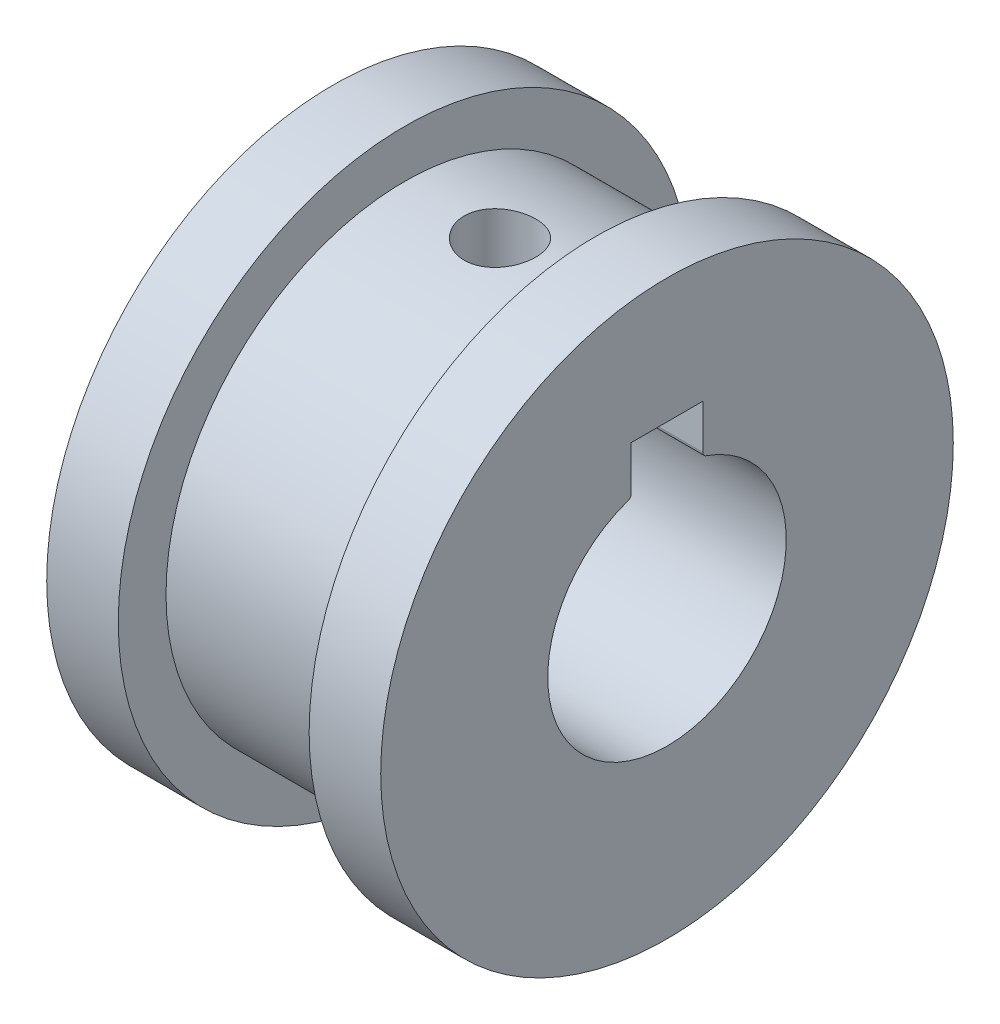
ISO-10303-21;
HEADER;
FILE_DESCRIPTION(('STEP AP214'),'2;1');
FILE_NAME('part.step','',(''),(''),'','','');
FILE_SCHEMA(('AUTOMOTIVE_DESIGN { 1 0 10303 214 1 1 1 1 }'));
ENDSEC;
DATA;
#1=APPLICATION_CONTEXT('core data for automotive mechanical design processes');
#2=APPLICATION_PROTOCOL_DEFINITION('international standard','automotive_design',2000,#1);
#3=PRODUCT_CONTEXT('',#1,'mechanical');
#4=PRODUCT('Part','Part','',(#3));
#5=PRODUCT_RELATED_PRODUCT_CATEGORY('part','',(#4));
#6=PRODUCT_DEFINITION_FORMATION('','',#4);
#7=PRODUCT_DEFINITION_CONTEXT('part definition',#1,'design');
#8=PRODUCT_DEFINITION('design','',#6,#7);
#9=PRODUCT_DEFINITION_SHAPE('','',#8);
#10=(LENGTH_UNIT() NAMED_UNIT(*) SI_UNIT(.MILLI.,.METRE.));
#11=(NAMED_UNIT(*) PLANE_ANGLE_UNIT() SI_UNIT($,.RADIAN.));
#12=(NAMED_UNIT(*) SI_UNIT($,.STERADIAN.) SOLID_ANGLE_UNIT());
#13=UNCERTAINTY_MEASURE_WITH_UNIT(LENGTH_MEASURE(1.E-05),#10,'distance_accuracy_value','');
#14=(GEOMETRIC_REPRESENTATION_CONTEXT(3) GLOBAL_UNCERTAINTY_ASSIGNED_CONTEXT((#13)) GLOBAL_UNIT_ASSIGNED_CONTEXT((#10,
#11,#12)) REPRESENTATION_CONTEXT('',''));
#15=CARTESIAN_POINT('',(0.,0.,0.));
#16=DIRECTION('',(0.,0.,1.));
#17=DIRECTION('',(1.,0.,0.));
#18=AXIS2_PLACEMENT_3D('',#15,#16,#17);
#19=CARTESIAN_POINT('',(11.,6.76969600708473,1.5));
#20=DIRECTION('',(0.,-1.,0.));
#21=DIRECTION('',(0.,0.,-1.));
#22=AXIS2_PLACEMENT_3D('',#19,#20,#21);
#23=PLANE('',#22);
#24=CARTESIAN_POINT('',(4.,6.76969600708473,0.));
#25=DIRECTION('',(0.,-1.,0.));
#26=DIRECTION('',(0.,0.,-1.));
#27=AXIS2_PLACEMENT_3D('',#24,#25,#26);
#28=CIRCLE('',#27,1.5);
#29=CARTESIAN_POINT('',(4.,6.76969600708473,-1.5));
#30=VERTEX_POINT('',#29);
#31=CARTESIAN_POINT('',(4.,6.76969600708473,1.5));
#32=VERTEX_POINT('',#31);
#33=EDGE_CURVE('E48',#30,#32,#28,.T.);
#34=ORIENTED_EDGE('',*,*,#33,.F.);
#35=DIRECTION('',(-1.,0.,0.));
#36=VECTOR('',#35,1.);
#37=CARTESIAN_POINT('',(11.,6.76969600708473,-1.5));
#38=LINE('',#37,#36);
#39=CARTESIAN_POINT('',(11.,6.76969600708473,-1.5));
#40=VERTEX_POINT('',#39);
#41=EDGE_CURVE('E100',#40,#30,#38,.T.);
#42=ORIENTED_EDGE('',*,*,#41,.F.);
#43=DIRECTION('',(0.,0.,1.));
#44=VECTOR('',#43,1.);
#45=CARTESIAN_POINT('',(11.,6.76969600708473,1.5));
#46=LINE('',#45,#44);
#47=CARTESIAN_POINT('',(11.,6.76969600708473,1.5));
#48=VERTEX_POINT('',#47);
#49=EDGE_CURVE('E217',#40,#48,#46,.T.);
#50=ORIENTED_EDGE('',*,*,#49,.T.);
#51=DIRECTION('',(-1.,0.,0.));
#52=VECTOR('',#51,1.);
#53=CARTESIAN_POINT('',(11.,6.76969600708473,1.5));
#54=LINE('',#53,#52);
#55=EDGE_CURVE('E56',#48,#32,#54,.T.);
#56=ORIENTED_EDGE('',*,*,#55,.T.);
#57=EDGE_LOOP('',(#34,#42,#50,#56));
#58=FACE_BOUND('',#57,.T.);
#59=ADVANCED_FACE('F32',(#58),#23,.T.);
#60=CARTESIAN_POINT('',(11.,0.,0.));
#61=DIRECTION('',(1.,0.,0.));
#62=DIRECTION('',(0.,0.,-1.));
#63=AXIS2_PLACEMENT_3D('',#60,#61,#62);
#64=PLANE('',#63);
#65=CARTESIAN_POINT('',(11.,0.,0.));
#66=DIRECTION('',(1.,0.,0.));
#67=DIRECTION('',(0.,0.,-1.));
#68=AXIS2_PLACEMENT_3D('',#65,#66,#67);
#69=CIRCLE('',#68,12.);
#70=CARTESIAN_POINT('',(11.,0.,-12.));
#71=VERTEX_POINT('',#70);
#72=EDGE_CURVE('E42',#71,#71,#69,.T.);
#73=ORIENTED_EDGE('',*,*,#72,.T.);
#74=EDGE_LOOP('',(#73));
#75=FACE_BOUND('',#74,.T.);
#76=CARTESIAN_POINT('',(11.,0.,0.));
#77=DIRECTION('',(1.,0.,0.));
#78=DIRECTION('',(0.,0.,-1.));
#79=AXIS2_PLACEMENT_3D('',#76,#77,#78);
#80=CIRCLE('',#79,5.);
#81=CARTESIAN_POINT('',(11.,4.72525475973293,1.63461538461539));
#82=VERTEX_POINT('',#81);
#83=CARTESIAN_POINT('',(11.,4.72525475973293,-1.63461538461538));
#84=VERTEX_POINT('',#83);
#85=EDGE_CURVE('E207',#82,#84,#80,.T.);
#86=ORIENTED_EDGE('',*,*,#85,.F.);
#87=CARTESIAN_POINT('',(11.,4.91426495012224,1.7));
#88=DIRECTION('',(-1.,0.,0.));
#89=DIRECTION('',(0.,0.,-1.));
#90=AXIS2_PLACEMENT_3D('',#87,#88,#89);
#91=CIRCLE('',#90,0.2);
#92=CARTESIAN_POINT('',(11.,4.91426495012224,1.5));
#93=VERTEX_POINT('',#92);
#94=EDGE_CURVE('E205',#93,#82,#91,.T.);
#95=ORIENTED_EDGE('',*,*,#94,.F.);
#96=DIRECTION('',(0.,-1.,0.));
#97=VECTOR('',#96,1.);
#98=CARTESIAN_POINT('',(11.,6.76969600708473,1.5));
#99=LINE('',#98,#97);
#100=EDGE_CURVE('E219',#48,#93,#99,.T.);
#101=ORIENTED_EDGE('',*,*,#100,.F.);
#102=ORIENTED_EDGE('',*,*,#49,.F.);
#103=DIRECTION('',(0.,1.,0.));
#104=VECTOR('',#103,1.);
#105=CARTESIAN_POINT('',(11.,6.76969600708473,-1.5));
#106=LINE('',#105,#104);
#107=CARTESIAN_POINT('',(11.,4.91426495012225,-1.5));
#108=VERTEX_POINT('',#107);
#109=EDGE_CURVE('E115',#108,#40,#106,.T.);
#110=ORIENTED_EDGE('',*,*,#109,.F.);
#111=CARTESIAN_POINT('',(11.,4.91426495012225,-1.7));
#112=DIRECTION('',(-1.,0.,0.));
#113=DIRECTION('',(0.,0.,1.));
#114=AXIS2_PLACEMENT_3D('',#111,#112,#113);
#115=CIRCLE('',#114,0.2);
#116=EDGE_CURVE('E214',#84,#108,#115,.T.);
#117=ORIENTED_EDGE('',*,*,#116,.F.);
#118=EDGE_LOOP('',(#86,#95,#101,#102,#110,#117));
#119=FACE_BOUND('',#118,.T.);
#120=ADVANCED_FACE('F162',(#75,#119),#64,.T.);
#121=CARTESIAN_POINT('',(-3.,0.,0.));
#122=DIRECTION('',(-1.,0.,0.));
#123=DIRECTION('',(0.,0.,1.));
#124=AXIS2_PLACEMENT_3D('',#121,#122,#123);
#125=PLANE('',#124);
#126=CARTESIAN_POINT('',(-3.,0.,0.));
#127=DIRECTION('',(-1.,0.,0.));
#128=DIRECTION('',(0.,0.,1.));
#129=AXIS2_PLACEMENT_3D('',#126,#127,#128);
#130=CIRCLE('',#129,12.);
#131=CARTESIAN_POINT('',(-3.,0.,12.));
#132=VERTEX_POINT('',#131);
#133=EDGE_CURVE('E126',#132,#132,#130,.T.);
#134=ORIENTED_EDGE('',*,*,#133,.T.);
#135=EDGE_LOOP('',(#134));
#136=FACE_BOUND('',#135,.T.);
#137=DIRECTION('',(0.,-1.,0.));
#138=VECTOR('',#137,1.);
#139=CARTESIAN_POINT('',(-3.,6.76969600708473,1.5));
#140=LINE('',#139,#138);
#141=CARTESIAN_POINT('',(-3.,6.76969600708473,1.5));
#142=VERTEX_POINT('',#141);
#143=CARTESIAN_POINT('',(-3.,4.91426495012224,1.5));
#144=VERTEX_POINT('',#143);
#145=EDGE_CURVE('E201',#142,#144,#140,.T.);
#146=ORIENTED_EDGE('',*,*,#145,.T.);
#147=CARTESIAN_POINT('',(-3.,4.91426495012224,1.7));
#148=DIRECTION('',(-1.,0.,0.));
#149=DIRECTION('',(0.,0.,-1.));
#150=AXIS2_PLACEMENT_3D('',#147,#148,#149);
#151=CIRCLE('',#150,0.2);
#152=CARTESIAN_POINT('',(-3.,4.72525475973293,1.63461538461539));
#153=VERTEX_POINT('',#152);
#154=EDGE_CURVE('E203',#144,#153,#151,.T.);
#155=ORIENTED_EDGE('',*,*,#154,.T.);
#156=CARTESIAN_POINT('',(-3.,0.,0.));
#157=DIRECTION('',(1.,0.,0.));
#158=DIRECTION('',(0.,0.,-1.));
#159=AXIS2_PLACEMENT_3D('',#156,#157,#158);
#160=CIRCLE('',#159,5.);
#161=CARTESIAN_POINT('',(-3.,4.72525475973293,-1.63461538461538));
#162=VERTEX_POINT('',#161);
#163=EDGE_CURVE('E234',#153,#162,#160,.T.);
#164=ORIENTED_EDGE('',*,*,#163,.T.);
#165=CARTESIAN_POINT('',(-3.,4.91426495012225,-1.7));
#166=DIRECTION('',(-1.,0.,0.));
#167=DIRECTION('',(0.,0.,1.));
#168=AXIS2_PLACEMENT_3D('',#165,#166,#167);
#169=CIRCLE('',#168,0.2);
#170=CARTESIAN_POINT('',(-3.,4.91426495012225,-1.5));
#171=VERTEX_POINT('',#170);
#172=EDGE_CURVE('E233',#162,#171,#169,.T.);
#173=ORIENTED_EDGE('',*,*,#172,.T.);
#174=DIRECTION('',(0.,1.,0.));
#175=VECTOR('',#174,1.);
#176=CARTESIAN_POINT('',(-3.,6.76969600708473,-1.5));
#177=LINE('',#176,#175);
#178=CARTESIAN_POINT('',(-3.,6.76969600708473,-1.5));
#179=VERTEX_POINT('',#178);
#180=EDGE_CURVE('E209',#171,#179,#177,.T.);
#181=ORIENTED_EDGE('',*,*,#180,.T.);
#182=DIRECTION('',(0.,0.,1.));
#183=VECTOR('',#182,1.);
#184=CARTESIAN_POINT('',(-3.,6.76969600708473,1.5));
#185=LINE('',#184,#183);
#186=EDGE_CURVE('E107',#179,#142,#185,.T.);
#187=ORIENTED_EDGE('',*,*,#186,.T.);
#188=EDGE_LOOP('',(#146,#155,#164,#173,#181,#187));
#189=FACE_BOUND('',#188,.T.);
#190=ADVANCED_FACE('F167',(#136,#189),#125,.T.);
#191=CARTESIAN_POINT('',(8.,0.,0.));
#192=DIRECTION('',(-1.,0.,0.));
#193=DIRECTION('',(0.,0.,1.));
#194=AXIS2_PLACEMENT_3D('',#191,#192,#193);
#195=CYLINDRICAL_SURFACE('',#194,10.);
#196=CARTESIAN_POINT('',(4.,9.88685996664259,-1.5));
#197=CARTESIAN_POINT('',(4.08374556928995,9.88686136668592,-1.49999654107284));
#198=CARTESIAN_POINT('',(4.16753975075071,9.88793551739101,-1.49296296388491));
#199=CARTESIAN_POINT('',(4.33278531488313,9.8921131480324,-1.46502196657001));
#200=CARTESIAN_POINT('',(4.41423433148001,9.8952186073143,-1.44410101402628));
#201=CARTESIAN_POINT('',(4.5723737554469,9.90309938986228,-1.38902526098084));
#202=CARTESIAN_POINT('',(4.64906776254216,9.90787343131536,-1.35488061681397));
#203=CARTESIAN_POINT('',(4.79562703077208,9.91855194113145,-1.27435063087791));
#204=CARTESIAN_POINT('',(4.86549323021429,9.92445625383668,-1.22796697429872));
#205=CARTESIAN_POINT('',(4.99698381675433,9.93678289248039,-1.12387902418558));
#206=CARTESIAN_POINT('',(5.05854561340674,9.94320862458057,-1.0660960558482));
#207=CARTESIAN_POINT('',(5.1711374856555,9.95582368169047,-0.941019605444372));
#208=CARTESIAN_POINT('',(5.22216698216699,9.96201299368614,-0.873725600786528));
#209=CARTESIAN_POINT('',(5.31247663169136,9.97349347428185,-0.731136358052743));
#210=CARTESIAN_POINT('',(5.35169915032246,9.97878018435568,-0.655804227365765));
#211=CARTESIAN_POINT('',(5.41691159880817,9.98782206746404,-0.499528850106973));
#212=CARTESIAN_POINT('',(5.44290222784289,9.99157732141944,-0.418585900270676));
#213=CARTESIAN_POINT('',(5.48072338853084,9.99710914797782,-0.254031123090568));
#214=CARTESIAN_POINT('',(5.49265872638716,9.99890035887344,-0.170443884389865));
#215=CARTESIAN_POINT('',(5.50235593482489,10.0003524476958,-0.00243520401947788));
#216=CARTESIAN_POINT('',(5.50011859331969,10.0000134440494,0.0819861910157475));
#217=CARTESIAN_POINT('',(5.48161666223757,9.99725499660795,0.248551718200521));
#218=CARTESIAN_POINT('',(5.46546482820851,9.99485227652479,0.330708691400009));
#219=CARTESIAN_POINT('',(5.41976939367742,9.98825500227851,0.491132829143139));
#220=CARTESIAN_POINT('',(5.39022544849856,9.98406040199739,0.569399893513483));
#221=CARTESIAN_POINT('',(5.3184690030829,9.97432193873205,0.720163780770318));
#222=CARTESIAN_POINT('',(5.27620903489126,9.96877303515638,0.792637672323598));
#223=CARTESIAN_POINT('',(5.18025480633001,9.95694438245421,0.929507907150179));
#224=CARTESIAN_POINT('',(5.12655979329313,9.95066458523184,0.993903718271737));
#225=CARTESIAN_POINT('',(5.00863155117341,9.93800158192626,1.11345448272265));
#226=CARTESIAN_POINT('',(4.94429987802989,9.93161796623256,1.16851232950947));
#227=CARTESIAN_POINT('',(4.80725892287626,9.91952704453523,1.26706599338813));
#228=CARTESIAN_POINT('',(4.73454958928008,9.91381974269649,1.31056173927999));
#229=CARTESIAN_POINT('',(4.58271603705935,9.90372775286855,1.38476964534605));
#230=CARTESIAN_POINT('',(4.50358686633761,9.89934409845291,1.41547182270082));
#231=CARTESIAN_POINT('',(4.34121474485261,9.89241402899059,1.46312336208879));
#232=CARTESIAN_POINT('',(4.25797208445325,9.88986748446299,1.48007369337326));
#233=CARTESIAN_POINT('',(4.09059991042251,9.88692451395026,1.49960720086656));
#234=CARTESIAN_POINT('',(4.00648681179847,9.88650748802574,1.50232803265052));
#235=CARTESIAN_POINT('',(3.83900580518266,9.88781607937153,1.49369057019819));
#236=CARTESIAN_POINT('',(3.75563787414923,9.88954163015778,1.48233271282302));
#237=CARTESIAN_POINT('',(3.59244018203437,9.89492202461452,1.44597702952766));
#238=CARTESIAN_POINT('',(3.5125947950584,9.89856716482858,1.42104778527821));
#239=CARTESIAN_POINT('',(3.35821590795139,9.90736801825767,1.35832831947087));
#240=CARTESIAN_POINT('',(3.2836826703718,9.91252380607176,1.32053746276389));
#241=CARTESIAN_POINT('',(3.14142673966496,9.92381355687063,1.23283677995324));
#242=CARTESIAN_POINT('',(3.07375955272018,9.92995459279988,1.18283784561766));
#243=CARTESIAN_POINT('',(2.94772714012619,9.94250159433355,1.07226416837202));
#244=CARTESIAN_POINT('',(2.88936244081885,9.94890757490292,1.0116888274468));
#245=CARTESIAN_POINT('',(2.78309739336642,9.96132705217386,0.881075619628185));
#246=CARTESIAN_POINT('',(2.73528827175752,9.96733683460423,0.810963126771959));
#247=CARTESIAN_POINT('',(2.65212709473736,9.97822905032015,0.663622080263683));
#248=CARTESIAN_POINT('',(2.61677469853497,9.98311151444563,0.586393721360441));
#249=CARTESIAN_POINT('',(2.55967625751197,9.99118269660795,0.427297995861149));
#250=CARTESIAN_POINT('',(2.53788033292164,9.99437761717899,0.345448858754304));
#251=CARTESIAN_POINT('',(2.50835212046253,9.99873976656896,0.179200815501195));
#252=CARTESIAN_POINT('',(2.50061890375086,9.99990712930801,0.0948020781305827));
#253=CARTESIAN_POINT('',(2.4994582954506,10.0000812905914,-0.0732645908608166));
#254=CARTESIAN_POINT('',(2.50589131912302,9.99910917023796,-0.15693157021205));
#255=CARTESIAN_POINT('',(2.53258138842076,9.99515610519141,-0.321979795323105));
#256=CARTESIAN_POINT('',(2.55283838980856,9.99217516692666,-0.403361048396511));
#257=CARTESIAN_POINT('',(2.60655187557024,9.98453786742463,-0.561489374379659));
#258=CARTESIAN_POINT('',(2.63999869513893,9.97988273316947,-0.638239793148781));
#259=CARTESIAN_POINT('',(2.71912748798314,9.96940834495499,-0.785061117896601));
#260=CARTESIAN_POINT('',(2.76480985848034,9.96358905320338,-0.855131806920707));
#261=CARTESIAN_POINT('',(2.86761769882917,9.95136510636178,-0.987312585191957));
#262=CARTESIAN_POINT('',(2.92484622581634,9.94495548425941,-1.04934206644638));
#263=CARTESIAN_POINT('',(3.04890507308047,9.93231001689001,-1.16296808390268));
#264=CARTESIAN_POINT('',(3.11573764382434,9.92607421276291,-1.21456216798984));
#265=CARTESIAN_POINT('',(3.25754898323253,9.91444484029116,-1.30611310822974));
#266=CARTESIAN_POINT('',(3.33257141702183,9.90905620156985,-1.34600294291209));
#267=CARTESIAN_POINT('',(3.4882967767633,9.89978909110724,-1.41255613872045));
#268=CARTESIAN_POINT('',(3.56899370785782,9.89590905307931,-1.43923322574897));
#269=CARTESIAN_POINT('',(3.70837743625647,9.89099485524825,-1.47254951890026));
#270=CARTESIAN_POINT('',(3.76620339692427,9.88945249382379,-1.4828276978042));
#271=CARTESIAN_POINT('',(3.88267829173435,9.88738456567011,-1.49655410576574));
#272=CARTESIAN_POINT('',(3.94132721519961,9.88685898576155,-1.50000242335076));
#273=CARTESIAN_POINT('',(4.,9.88685996664259,-1.5));
#274=B_SPLINE_CURVE_WITH_KNOTS('',3,(#196,#197,#198,#199,#200,#201,#202,#203,#204,#205,#206,
#207,#208,#209,#210,#211,#212,#213,#214,#215,#216,#217,#218,#219,#220,#221,#222,#223,#224,#225,
#226,#227,#228,#229,#230,#231,#232,#233,#234,#235,#236,#237,#238,#239,#240,#241,#242,#243,#244,
#245,#246,#247,#248,#249,#250,#251,#252,#253,#254,#255,#256,#257,#258,#259,#260,#261,#262,#263,
#264,#265,#266,#267,#268,#269,#270,#271,#272,#273),.UNSPECIFIED.,.T.,.F.,(4,2,2,2,2,2,2,2,2,2,2,
2,2,2,2,2,2,2,2,2,2,2,2,2,2,2,2,2,2,2,2,2,2,2,2,2,2,2,4),(0.,0.251022251804868,
0.502289469561801,0.753364085335673,1.00440414866132,1.25724158649107,1.51009292207817,
1.76415922105782,2.018212093645,2.27035832534397,2.52249053939374,2.77259862515728,
3.02271314839401,3.27377316386453,3.52484970949272,3.77839544666269,4.0319427451435,
4.28568751773138,4.53941440444341,4.79068214603743,5.04194209099918,5.29194394807374,
5.54195815286117,5.79385486001302,6.04576581461801,6.29977537753515,6.55377799071854,
6.8068404089109,7.05988611170473,7.31044963622326,7.56101235892823,7.81139182257833,
8.06177941567106,8.31450950010969,8.56729890236862,8.82150878824931,9.07545403445564,
9.25132441891613,9.42719252376192),.UNSPECIFIED.);
#275=CARTESIAN_POINT('',(4.,9.88685996664259,-1.5));
#276=VERTEX_POINT('',#275);
#277=EDGE_CURVE('E102',#276,#276,#274,.T.);
#278=ORIENTED_EDGE('',*,*,#277,.T.);
#279=EDGE_LOOP('',(#278));
#280=FACE_BOUND('',#279,.T.);
#281=CARTESIAN_POINT('',(8.,0.,0.));
#282=DIRECTION('',(1.,0.,0.));
#283=DIRECTION('',(0.,0.,-1.));
#284=AXIS2_PLACEMENT_3D('',#281,#282,#283);
#285=CIRCLE('',#284,10.);
#286=CARTESIAN_POINT('',(8.,0.,-10.));
#287=VERTEX_POINT('',#286);
#288=EDGE_CURVE('E11',#287,#287,#285,.T.);
#289=ORIENTED_EDGE('',*,*,#288,.F.);
#290=EDGE_LOOP('',(#289));
#291=FACE_BOUND('',#290,.T.);
#292=CARTESIAN_POINT('',(0.,0.,0.));
#293=DIRECTION('',(1.,0.,0.));
#294=DIRECTION('',(0.,0.,-1.));
#295=AXIS2_PLACEMENT_3D('',#292,#293,#294);
#296=CIRCLE('',#295,10.);
#297=CARTESIAN_POINT('',(0.,0.,-10.));
#298=VERTEX_POINT('',#297);
#299=EDGE_CURVE('E37',#298,#298,#296,.T.);
#300=ORIENTED_EDGE('',*,*,#299,.T.);
#301=EDGE_LOOP('',(#300));
#302=FACE_BOUND('',#301,.T.);
#303=ADVANCED_FACE('F34',(#280,#291,#302),#195,.T.);
#304=CARTESIAN_POINT('',(11.,0.,0.));
#305=DIRECTION('',(-1.,0.,0.));
#306=DIRECTION('',(0.,0.,1.));
#307=AXIS2_PLACEMENT_3D('',#304,#305,#306);
#308=CYLINDRICAL_SURFACE('',#307,12.);
#309=ORIENTED_EDGE('',*,*,#72,.F.);
#310=EDGE_LOOP('',(#309));
#311=FACE_BOUND('',#310,.T.);
#312=CARTESIAN_POINT('',(8.,0.,0.));
#313=DIRECTION('',(1.,0.,0.));
#314=DIRECTION('',(0.,0.,-1.));
#315=AXIS2_PLACEMENT_3D('',#312,#313,#314);
#316=CIRCLE('',#315,12.);
#317=CARTESIAN_POINT('',(8.,0.,-12.));
#318=VERTEX_POINT('',#317);
#319=EDGE_CURVE('E133',#318,#318,#316,.T.);
#320=ORIENTED_EDGE('',*,*,#319,.T.);
#321=EDGE_LOOP('',(#320));
#322=FACE_BOUND('',#321,.T.);
#323=ADVANCED_FACE('F156',(#311,#322),#308,.T.);
#324=CARTESIAN_POINT('',(8.,0.,0.));
#325=DIRECTION('',(1.,0.,0.));
#326=DIRECTION('',(0.,0.,-1.));
#327=AXIS2_PLACEMENT_3D('',#324,#325,#326);
#328=PLANE('',#327);
#329=ORIENTED_EDGE('',*,*,#288,.T.);
#330=EDGE_LOOP('',(#329));
#331=FACE_BOUND('',#330,.T.);
#332=ORIENTED_EDGE('',*,*,#319,.F.);
#333=EDGE_LOOP('',(#332));
#334=FACE_BOUND('',#333,.T.);
#335=ADVANCED_FACE('F150',(#331,#334),#328,.F.);
#336=CARTESIAN_POINT('',(-3.,0.,0.));
#337=DIRECTION('',(1.,0.,0.));
#338=DIRECTION('',(0.,0.,-1.));
#339=AXIS2_PLACEMENT_3D('',#336,#337,#338);
#340=CYLINDRICAL_SURFACE('',#339,12.);
#341=ORIENTED_EDGE('',*,*,#133,.F.);
#342=EDGE_LOOP('',(#341));
#343=FACE_BOUND('',#342,.T.);
#344=CARTESIAN_POINT('',(0.,0.,0.));
#345=DIRECTION('',(-1.,0.,0.));
#346=DIRECTION('',(0.,0.,1.));
#347=AXIS2_PLACEMENT_3D('',#344,#345,#346);
#348=CIRCLE('',#347,12.);
#349=CARTESIAN_POINT('',(0.,0.,12.));
#350=VERTEX_POINT('',#349);
#351=EDGE_CURVE('E125',#350,#350,#348,.T.);
#352=ORIENTED_EDGE('',*,*,#351,.T.);
#353=EDGE_LOOP('',(#352));
#354=FACE_BOUND('',#353,.T.);
#355=ADVANCED_FACE('F145',(#343,#354),#340,.T.);
#356=CARTESIAN_POINT('',(0.,0.,0.));
#357=DIRECTION('',(-1.,0.,0.));
#358=DIRECTION('',(0.,0.,1.));
#359=AXIS2_PLACEMENT_3D('',#356,#357,#358);
#360=PLANE('',#359);
#361=ORIENTED_EDGE('',*,*,#299,.F.);
#362=EDGE_LOOP('',(#361));
#363=FACE_BOUND('',#362,.T.);
#364=ORIENTED_EDGE('',*,*,#351,.F.);
#365=EDGE_LOOP('',(#364));
#366=FACE_BOUND('',#365,.T.);
#367=ADVANCED_FACE('F141',(#363,#366),#360,.F.);
#368=CARTESIAN_POINT('',(11.,4.91426495012224,1.7));
#369=DIRECTION('',(-1.,0.,0.));
#370=DIRECTION('',(0.,0.,1.));
#371=AXIS2_PLACEMENT_3D('',#368,#369,#370);
#372=CYLINDRICAL_SURFACE('',#371,0.2);
#373=DIRECTION('',(-1.,0.,0.));
#374=VECTOR('',#373,1.);
#375=CARTESIAN_POINT('',(11.,4.91426495012224,1.5));
#376=LINE('',#375,#374);
#377=EDGE_CURVE('E220',#93,#144,#376,.T.);
#378=ORIENTED_EDGE('',*,*,#377,.F.);
#379=ORIENTED_EDGE('',*,*,#94,.T.);
#380=DIRECTION('',(-1.,0.,0.));
#381=VECTOR('',#380,1.);
#382=CARTESIAN_POINT('',(11.,4.72525475973293,1.63461538461539));
#383=LINE('',#382,#381);
#384=EDGE_CURVE('E123',#82,#153,#383,.T.);
#385=ORIENTED_EDGE('',*,*,#384,.T.);
#386=ORIENTED_EDGE('',*,*,#154,.F.);
#387=EDGE_LOOP('',(#378,#379,#385,#386));
#388=FACE_BOUND('',#387,.T.);
#389=ADVANCED_FACE('F144',(#388),#372,.T.);
#390=CARTESIAN_POINT('',(11.,0.,0.));
#391=DIRECTION('',(-1.,0.,0.));
#392=DIRECTION('',(0.,0.,1.));
#393=AXIS2_PLACEMENT_3D('',#390,#391,#392);
#394=CYLINDRICAL_SURFACE('',#393,5.);
#395=ORIENTED_EDGE('',*,*,#384,.F.);
#396=ORIENTED_EDGE('',*,*,#85,.T.);
#397=DIRECTION('',(-1.,0.,0.));
#398=VECTOR('',#397,1.);
#399=CARTESIAN_POINT('',(11.,4.72525475973293,-1.63461538461538));
#400=LINE('',#399,#398);
#401=EDGE_CURVE('E117',#84,#162,#400,.T.);
#402=ORIENTED_EDGE('',*,*,#401,.T.);
#403=ORIENTED_EDGE('',*,*,#163,.F.);
#404=EDGE_LOOP('',(#395,#396,#402,#403));
#405=FACE_BOUND('',#404,.T.);
#406=ADVANCED_FACE('F181',(#405),#394,.F.);
#407=CARTESIAN_POINT('',(11.,4.91426495012225,-1.7));
#408=DIRECTION('',(-1.,0.,0.));
#409=DIRECTION('',(0.,0.,1.));
#410=AXIS2_PLACEMENT_3D('',#407,#408,#409);
#411=CYLINDRICAL_SURFACE('',#410,0.2);
#412=ORIENTED_EDGE('',*,*,#401,.F.);
#413=ORIENTED_EDGE('',*,*,#116,.T.);
#414=DIRECTION('',(-1.,0.,0.));
#415=VECTOR('',#414,1.);
#416=CARTESIAN_POINT('',(11.,4.91426495012225,-1.5));
#417=LINE('',#416,#415);
#418=EDGE_CURVE('E116',#108,#171,#417,.T.);
#419=ORIENTED_EDGE('',*,*,#418,.T.);
#420=ORIENTED_EDGE('',*,*,#172,.F.);
#421=EDGE_LOOP('',(#412,#413,#419,#420));
#422=FACE_BOUND('',#421,.T.);
#423=ADVANCED_FACE('F177',(#422),#411,.T.);
#424=CARTESIAN_POINT('',(11.,6.76969600708473,-1.5));
#425=DIRECTION('',(0.,0.,1.));
#426=DIRECTION('',(0.,-1.,0.));
#427=AXIS2_PLACEMENT_3D('',#424,#425,#426);
#428=PLANE('',#427);
#429=ORIENTED_EDGE('',*,*,#418,.F.);
#430=ORIENTED_EDGE('',*,*,#109,.T.);
#431=ORIENTED_EDGE('',*,*,#41,.T.);
#432=EDGE_CURVE('E104',#30,#179,#38,.T.);
#433=ORIENTED_EDGE('',*,*,#432,.T.);
#434=ORIENTED_EDGE('',*,*,#180,.F.);
#435=EDGE_LOOP('',(#429,#430,#431,#433,#434));
#436=FACE_BOUND('',#435,.T.);
#437=ADVANCED_FACE('F113',(#436),#428,.T.);
#438=EDGE_CURVE('E91',#32,#30,#28,.T.);
#439=ORIENTED_EDGE('',*,*,#438,.F.);
#440=EDGE_CURVE('E221',#32,#142,#54,.T.);
#441=ORIENTED_EDGE('',*,*,#440,.T.);
#442=ORIENTED_EDGE('',*,*,#186,.F.);
#443=ORIENTED_EDGE('',*,*,#432,.F.);
#444=EDGE_LOOP('',(#439,#441,#442,#443));
#445=FACE_BOUND('',#444,.T.);
#446=ADVANCED_FACE('F105',(#445),#23,.T.);
#447=CARTESIAN_POINT('',(11.,6.76969600708473,1.5));
#448=DIRECTION('',(0.,0.,-1.));
#449=DIRECTION('',(0.,1.,0.));
#450=AXIS2_PLACEMENT_3D('',#447,#448,#449);
#451=PLANE('',#450);
#452=ORIENTED_EDGE('',*,*,#55,.F.);
#453=ORIENTED_EDGE('',*,*,#100,.T.);
#454=ORIENTED_EDGE('',*,*,#377,.T.);
#455=ORIENTED_EDGE('',*,*,#145,.F.);
#456=ORIENTED_EDGE('',*,*,#440,.F.);
#457=EDGE_LOOP('',(#452,#453,#454,#455,#456));
#458=FACE_BOUND('',#457,.T.);
#459=ADVANCED_FACE('F172',(#458),#451,.T.);
#460=CARTESIAN_POINT('',(4.,11.7696960070847,0.));
#461=DIRECTION('',(0.,-1.,0.));
#462=DIRECTION('',(0.,0.,-1.));
#463=AXIS2_PLACEMENT_3D('',#460,#461,#462);
#464=CYLINDRICAL_SURFACE('',#463,1.5);
#465=ORIENTED_EDGE('',*,*,#33,.T.);
#466=ORIENTED_EDGE('',*,*,#438,.T.);
#467=EDGE_LOOP('',(#465,#466));
#468=FACE_BOUND('',#467,.T.);
#469=ORIENTED_EDGE('',*,*,#277,.F.);
#470=EDGE_LOOP('',(#469));
#471=FACE_BOUND('',#470,.T.);
#472=ADVANCED_FACE('F92',(#468,#471),#464,.F.);
#473=CLOSED_SHELL('',(#59,#120,#190,#303,#323,#335,#355,#367,#389,#406,#423,#437,#446,#459,#472));
#474=MANIFOLD_SOLID_BREP('B2',#473);
#475=ADVANCED_BREP_SHAPE_REPRESENTATION('',(#18,#474),#14);
#476=SHAPE_DEFINITION_REPRESENTATION(#9,#475);
ENDSEC;
END-ISO-10303-21;
